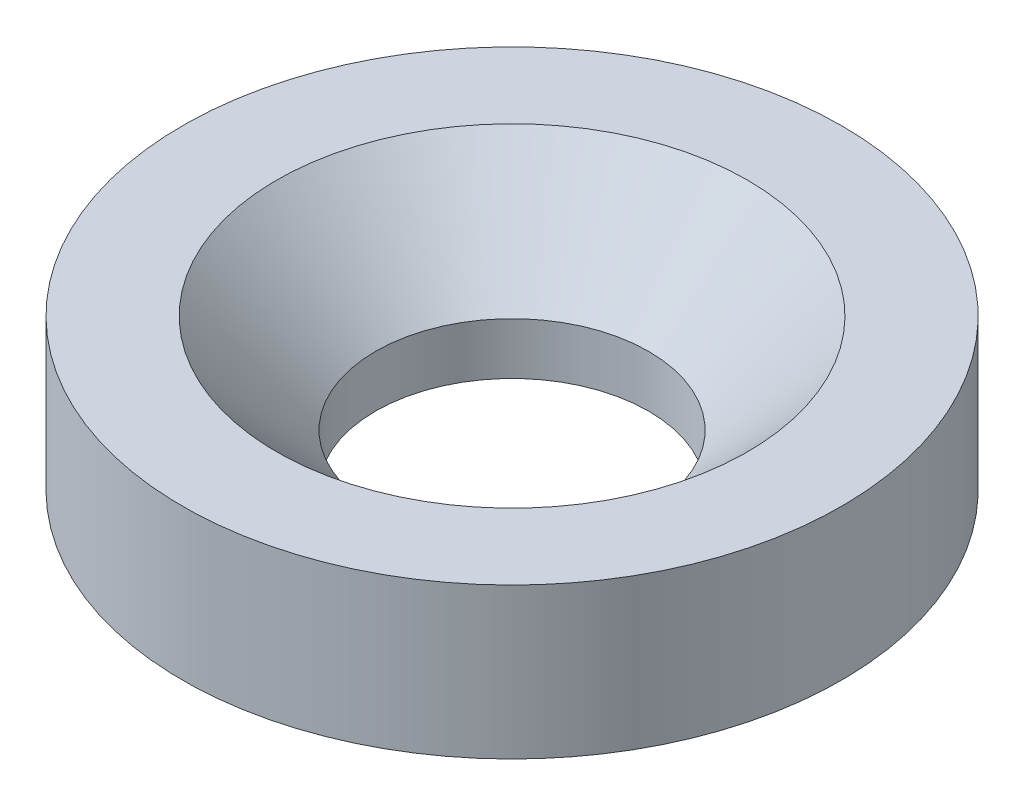
ISO-10303-21;
HEADER;
FILE_DESCRIPTION(('STEP AP214'),'2;1');
FILE_NAME('part.step','',(''),(''),'','','');
FILE_SCHEMA(('AUTOMOTIVE_DESIGN { 1 0 10303 214 1 1 1 1 }'));
ENDSEC;
DATA;
#1=APPLICATION_CONTEXT('core data for automotive mechanical design processes');
#2=APPLICATION_PROTOCOL_DEFINITION('international standard','automotive_design',2000,#1);
#3=PRODUCT_CONTEXT('',#1,'mechanical');
#4=PRODUCT('Part','Part','',(#3));
#5=PRODUCT_RELATED_PRODUCT_CATEGORY('part','',(#4));
#6=PRODUCT_DEFINITION_FORMATION('','',#4);
#7=PRODUCT_DEFINITION_CONTEXT('part definition',#1,'design');
#8=PRODUCT_DEFINITION('design','',#6,#7);
#9=PRODUCT_DEFINITION_SHAPE('','',#8);
#10=(LENGTH_UNIT() NAMED_UNIT(*) SI_UNIT(.MILLI.,.METRE.));
#11=(NAMED_UNIT(*) PLANE_ANGLE_UNIT() SI_UNIT($,.RADIAN.));
#12=(NAMED_UNIT(*) SI_UNIT($,.STERADIAN.) SOLID_ANGLE_UNIT());
#13=UNCERTAINTY_MEASURE_WITH_UNIT(LENGTH_MEASURE(1.E-05),#10,'distance_accuracy_value','');
#14=(GEOMETRIC_REPRESENTATION_CONTEXT(3) GLOBAL_UNCERTAINTY_ASSIGNED_CONTEXT((#13)) GLOBAL_UNIT_ASSIGNED_CONTEXT((#10,
#11,#12)) REPRESENTATION_CONTEXT('',''));
#15=CARTESIAN_POINT('',(0.,0.,0.));
#16=DIRECTION('',(0.,0.,1.));
#17=DIRECTION('',(1.,0.,0.));
#18=AXIS2_PLACEMENT_3D('',#15,#16,#17);
#19=CARTESIAN_POINT('',(0.,0.,0.));
#20=DIRECTION('',(0.,-1.,0.));
#21=DIRECTION('',(0.,0.,-1.));
#22=AXIS2_PLACEMENT_3D('',#19,#20,#21);
#23=CYLINDRICAL_SURFACE('',#22,7.25);
#24=CARTESIAN_POINT('',(0.,0.,0.));
#25=DIRECTION('',(0.,-1.,0.));
#26=DIRECTION('',(0.,0.,-1.));
#27=AXIS2_PLACEMENT_3D('',#24,#25,#26);
#28=CIRCLE('',#27,7.25);
#29=CARTESIAN_POINT('',(0.,0.,-7.25));
#30=VERTEX_POINT('',#29);
#31=EDGE_CURVE('E10',#30,#30,#28,.T.);
#32=ORIENTED_EDGE('',*,*,#31,.T.);
#33=EDGE_LOOP('',(#32));
#34=FACE_BOUND('',#33,.T.);
#35=CARTESIAN_POINT('',(0.,2.74999999999994,0.));
#36=DIRECTION('',(0.,-1.,0.));
#37=DIRECTION('',(0.,0.,-1.));
#38=AXIS2_PLACEMENT_3D('',#35,#36,#37);
#39=CIRCLE('',#38,7.25);
#40=CARTESIAN_POINT('',(0.,2.74999999999994,-7.25));
#41=VERTEX_POINT('',#40);
#42=EDGE_CURVE('E50',#41,#41,#39,.T.);
#43=ORIENTED_EDGE('',*,*,#42,.F.);
#44=EDGE_LOOP('',(#43));
#45=FACE_BOUND('',#44,.T.);
#46=ADVANCED_FACE('F31',(#34,#45),#23,.F.);
#47=CARTESIAN_POINT('',(7.25,0.,0.));
#48=DIRECTION('',(0.,-1.,0.));
#49=DIRECTION('',(0.,0.,-1.));
#50=AXIS2_PLACEMENT_3D('',#47,#48,#49);
#51=PLANE('',#50);
#52=CARTESIAN_POINT('',(0.,0.,0.));
#53=DIRECTION('',(0.,-1.,0.));
#54=DIRECTION('',(0.,0.,-1.));
#55=AXIS2_PLACEMENT_3D('',#52,#53,#54);
#56=CIRCLE('',#55,17.5);
#57=CARTESIAN_POINT('',(0.,0.,-17.5));
#58=VERTEX_POINT('',#57);
#59=EDGE_CURVE('E37',#58,#58,#56,.T.);
#60=ORIENTED_EDGE('',*,*,#59,.T.);
#61=EDGE_LOOP('',(#60));
#62=FACE_BOUND('',#61,.T.);
#63=ORIENTED_EDGE('',*,*,#31,.F.);
#64=EDGE_LOOP('',(#63));
#65=FACE_BOUND('',#64,.T.);
#66=ADVANCED_FACE('F58',(#62,#65),#51,.T.);
#67=CARTESIAN_POINT('',(0.,0.,0.));
#68=DIRECTION('',(0.,-1.,0.));
#69=DIRECTION('',(0.,0.,-1.));
#70=AXIS2_PLACEMENT_3D('',#67,#68,#69);
#71=CYLINDRICAL_SURFACE('',#70,17.5);
#72=CARTESIAN_POINT('',(0.,8.,0.));
#73=DIRECTION('',(0.,-1.,0.));
#74=DIRECTION('',(0.,0.,-1.));
#75=AXIS2_PLACEMENT_3D('',#72,#73,#74);
#76=CIRCLE('',#75,17.5);
#77=CARTESIAN_POINT('',(0.,8.,-17.5));
#78=VERTEX_POINT('',#77);
#79=EDGE_CURVE('E41',#78,#78,#76,.T.);
#80=ORIENTED_EDGE('',*,*,#79,.T.);
#81=EDGE_LOOP('',(#80));
#82=FACE_BOUND('',#81,.T.);
#83=ORIENTED_EDGE('',*,*,#59,.F.);
#84=EDGE_LOOP('',(#83));
#85=FACE_BOUND('',#84,.T.);
#86=ADVANCED_FACE('F62',(#82,#85),#71,.T.);
#87=CARTESIAN_POINT('',(17.5,8.,0.));
#88=DIRECTION('',(0.,1.,0.));
#89=DIRECTION('',(0.,0.,1.));
#90=AXIS2_PLACEMENT_3D('',#87,#88,#89);
#91=PLANE('',#90);
#92=CARTESIAN_POINT('',(0.,8.,0.));
#93=DIRECTION('',(0.,-1.,0.));
#94=DIRECTION('',(0.,0.,-1.));
#95=AXIS2_PLACEMENT_3D('',#92,#93,#94);
#96=CIRCLE('',#95,12.5);
#97=CARTESIAN_POINT('',(0.,8.,-12.5));
#98=VERTEX_POINT('',#97);
#99=EDGE_CURVE('E45',#98,#98,#96,.T.);
#100=ORIENTED_EDGE('',*,*,#99,.T.);
#101=EDGE_LOOP('',(#100));
#102=FACE_BOUND('',#101,.T.);
#103=ORIENTED_EDGE('',*,*,#79,.F.);
#104=EDGE_LOOP('',(#103));
#105=FACE_BOUND('',#104,.T.);
#106=ADVANCED_FACE('F66',(#102,#105),#91,.T.);
#107=CARTESIAN_POINT('',(0.,8.,0.));
#108=DIRECTION('',(0.,1.,0.));
#109=DIRECTION('',(0.,0.,1.));
#110=AXIS2_PLACEMENT_3D('',#107,#108,#109);
#111=CONICAL_SURFACE('',#110,12.5,0.785398163397443);
#112=ORIENTED_EDGE('',*,*,#42,.T.);
#113=EDGE_LOOP('',(#112));
#114=FACE_BOUND('',#113,.T.);
#115=ORIENTED_EDGE('',*,*,#99,.F.);
#116=EDGE_LOOP('',(#115));
#117=FACE_BOUND('',#116,.T.);
#118=ADVANCED_FACE('F54',(#114,#117),#111,.F.);
#119=CLOSED_SHELL('',(#46,#66,#86,#106,#118));
#120=MANIFOLD_SOLID_BREP('B2',#119);
#121=ADVANCED_BREP_SHAPE_REPRESENTATION('',(#18,#120),#14);
#122=SHAPE_DEFINITION_REPRESENTATION(#9,#121);
ENDSEC;
END-ISO-10303-21;
